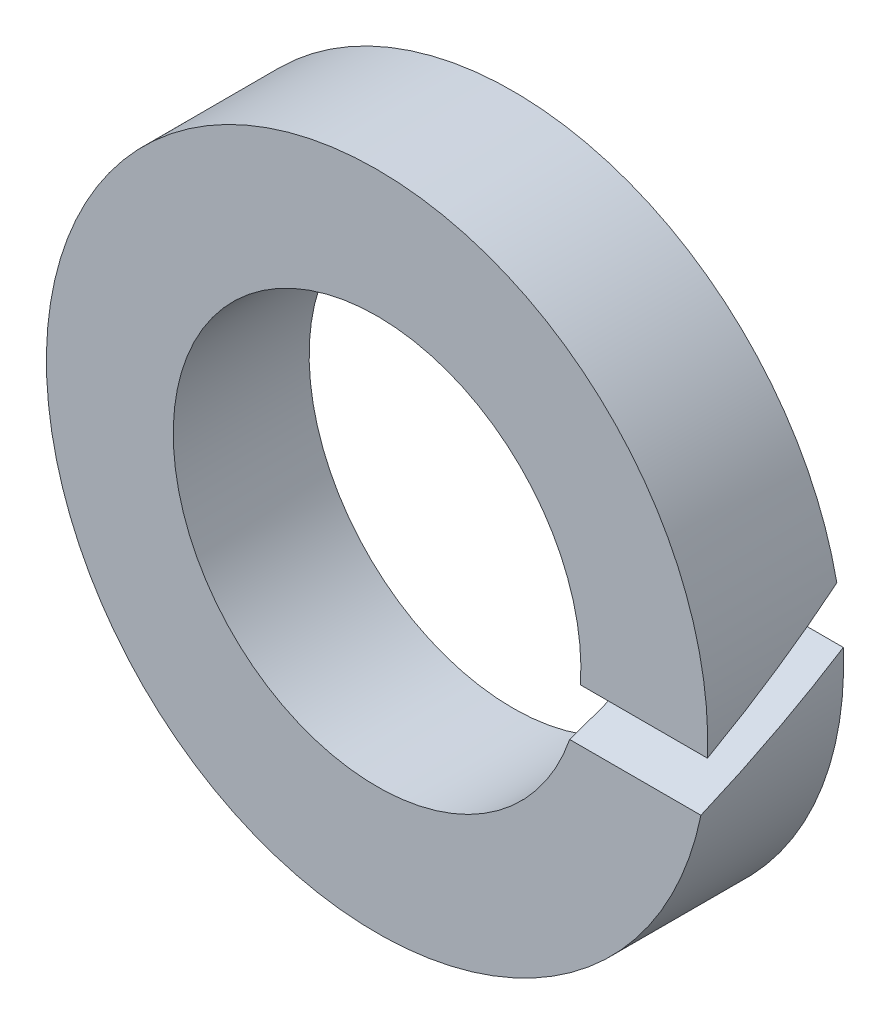
ISO-10303-21;
HEADER;
FILE_DESCRIPTION(('STEP AP214'),'2;1');
FILE_NAME('part.step','',(''),(''),'','','');
FILE_SCHEMA(('AUTOMOTIVE_DESIGN { 1 0 10303 214 1 1 1 1 }'));
ENDSEC;
DATA;
#1=APPLICATION_CONTEXT('core data for automotive mechanical design processes');
#2=APPLICATION_PROTOCOL_DEFINITION('international standard','automotive_design',2000,#1);
#3=PRODUCT_CONTEXT('',#1,'mechanical');
#4=PRODUCT('Part','Part','',(#3));
#5=PRODUCT_RELATED_PRODUCT_CATEGORY('part','',(#4));
#6=PRODUCT_DEFINITION_FORMATION('','',#4);
#7=PRODUCT_DEFINITION_CONTEXT('part definition',#1,'design');
#8=PRODUCT_DEFINITION('design','',#6,#7);
#9=PRODUCT_DEFINITION_SHAPE('','',#8);
#10=(LENGTH_UNIT() NAMED_UNIT(*) SI_UNIT(.MILLI.,.METRE.));
#11=(NAMED_UNIT(*) PLANE_ANGLE_UNIT() SI_UNIT($,.RADIAN.));
#12=(NAMED_UNIT(*) SI_UNIT($,.STERADIAN.) SOLID_ANGLE_UNIT());
#13=UNCERTAINTY_MEASURE_WITH_UNIT(LENGTH_MEASURE(1.E-05),#10,'distance_accuracy_value','');
#14=(GEOMETRIC_REPRESENTATION_CONTEXT(3) GLOBAL_UNCERTAINTY_ASSIGNED_CONTEXT((#13)) GLOBAL_UNIT_ASSIGNED_CONTEXT((#10,
#11,#12)) REPRESENTATION_CONTEXT('',''));
#15=CARTESIAN_POINT('',(0.,0.,0.));
#16=DIRECTION('',(0.,0.,1.));
#17=DIRECTION('',(1.,0.,0.));
#18=AXIS2_PLACEMENT_3D('',#15,#16,#17);
#19=CARTESIAN_POINT('',(0.,0.,1.5));
#20=DIRECTION('',(0.,0.,1.));
#21=DIRECTION('',(1.,0.,0.));
#22=AXIS2_PLACEMENT_3D('',#19,#20,#21);
#23=PLANE('',#22);
#24=CARTESIAN_POINT('',(0.,0.,1.5));
#25=DIRECTION('',(0.,0.,1.));
#26=DIRECTION('',(1.,0.,0.));
#27=AXIS2_PLACEMENT_3D('',#24,#25,#26);
#28=CIRCLE('',#27,3.65);
#29=CARTESIAN_POINT('',(3.64673621354377,-0.154321057627028,1.5));
#30=VERTEX_POINT('',#29);
#31=CARTESIAN_POINT('',(3.57508384039289,-0.735714301996038,1.5));
#32=VERTEX_POINT('',#31);
#33=EDGE_CURVE('E78',#30,#32,#28,.T.);
#34=ORIENTED_EDGE('',*,*,#33,.T.);
#35=DIRECTION('',(-1.,0.,0.));
#36=VECTOR('',#35,1.);
#37=CARTESIAN_POINT('',(3.64999999999992,-0.735714301995983,1.5));
#38=LINE('',#37,#36);
#39=CARTESIAN_POINT('',(2.12631711318838,-0.735714301995871,1.5));
#40=VERTEX_POINT('',#39);
#41=EDGE_CURVE('E80',#32,#40,#38,.T.);
#42=ORIENTED_EDGE('',*,*,#41,.T.);
#43=CARTESIAN_POINT('',(0.,0.,1.5));
#44=DIRECTION('',(0.,0.,1.));
#45=DIRECTION('',(1.,0.,0.));
#46=AXIS2_PLACEMENT_3D('',#43,#44,#45);
#47=CIRCLE('',#46,2.25);
#48=CARTESIAN_POINT('',(2.24470154166919,-0.154321057627055,1.5));
#49=VERTEX_POINT('',#48);
#50=EDGE_CURVE('E90',#49,#40,#47,.T.);
#51=ORIENTED_EDGE('',*,*,#50,.F.);
#52=DIRECTION('',(-1.,0.,0.));
#53=VECTOR('',#52,1.);
#54=CARTESIAN_POINT('',(3.64999999999992,-0.154321057627167,1.5));
#55=LINE('',#54,#53);
#56=EDGE_CURVE('E54',#30,#49,#55,.T.);
#57=ORIENTED_EDGE('',*,*,#56,.F.);
#58=EDGE_LOOP('',(#34,#42,#51,#57));
#59=FACE_BOUND('',#58,.T.);
#60=ADVANCED_FACE('F32',(#59),#23,.T.);
#61=CARTESIAN_POINT('',(0.,0.,0.));
#62=DIRECTION('',(0.,0.,1.));
#63=DIRECTION('',(1.,0.,0.));
#64=AXIS2_PLACEMENT_3D('',#61,#62,#63);
#65=PLANE('',#64);
#66=DIRECTION('',(-1.,0.,0.));
#67=VECTOR('',#66,1.);
#68=CARTESIAN_POINT('',(3.64999999999984,0.154321057627443,0.));
#69=LINE('',#68,#67);
#70=CARTESIAN_POINT('',(3.64673621354383,0.154321057627359,0.));
#71=VERTEX_POINT('',#70);
#72=CARTESIAN_POINT('',(2.24470154166922,0.154321057627305,0.));
#73=VERTEX_POINT('',#72);
#74=EDGE_CURVE('E47',#71,#73,#69,.T.);
#75=ORIENTED_EDGE('',*,*,#74,.F.);
#76=CARTESIAN_POINT('',(0.,0.,0.));
#77=DIRECTION('',(0.,0.,1.));
#78=DIRECTION('',(1.,0.,0.));
#79=AXIS2_PLACEMENT_3D('',#76,#77,#78);
#80=CIRCLE('',#79,3.65);
#81=CARTESIAN_POINT('',(3.57508384039275,0.735714301996239,0.));
#82=VERTEX_POINT('',#81);
#83=EDGE_CURVE('E76',#82,#71,#80,.T.);
#84=ORIENTED_EDGE('',*,*,#83,.F.);
#85=DIRECTION('',(-1.,0.,0.));
#86=VECTOR('',#85,1.);
#87=CARTESIAN_POINT('',(3.64999999999987,0.735714301996231,0.));
#88=LINE('',#87,#86);
#89=CARTESIAN_POINT('',(2.12631711318841,0.735714301996288,0.));
#90=VERTEX_POINT('',#89);
#91=EDGE_CURVE('E83',#82,#90,#88,.T.);
#92=ORIENTED_EDGE('',*,*,#91,.T.);
#93=CARTESIAN_POINT('',(0.,0.,0.));
#94=DIRECTION('',(0.,0.,1.));
#95=DIRECTION('',(1.,0.,0.));
#96=AXIS2_PLACEMENT_3D('',#93,#94,#95);
#97=CIRCLE('',#96,2.25);
#98=EDGE_CURVE('E94',#90,#73,#97,.T.);
#99=ORIENTED_EDGE('',*,*,#98,.T.);
#100=EDGE_LOOP('',(#75,#84,#92,#99));
#101=FACE_BOUND('',#100,.T.);
#102=ADVANCED_FACE('F89',(#101),#65,.F.);
#103=CARTESIAN_POINT('',(0.,0.,1.5));
#104=DIRECTION('',(0.,0.,-1.));
#105=DIRECTION('',(-1.,0.,0.));
#106=AXIS2_PLACEMENT_3D('',#103,#104,#105);
#107=CYLINDRICAL_SURFACE('',#106,3.65);
#108=CARTESIAN_POINT('',(0.,0.,0.26008133714911));
#109=DIRECTION('',(0.,0.860003112940858,0.510288786602296));
#110=DIRECTION('',(0.,0.510288786602297,-0.860003112940853));
#111=AXIS2_PLACEMENT_3D('',#108,#109,#110);
#112=ELLIPSE('',#111,7.15281247762301,3.65);
#113=EDGE_CURVE('E79',#32,#71,#112,.T.);
#114=ORIENTED_EDGE('',*,*,#113,.F.);
#115=ORIENTED_EDGE('',*,*,#33,.F.);
#116=CARTESIAN_POINT('',(0.,0.,1.23991866285089));
#117=DIRECTION('',(0.,0.860003112940859,0.510288786602296));
#118=DIRECTION('',(0.,0.510288786602297,-0.860003112940853));
#119=AXIS2_PLACEMENT_3D('',#116,#117,#118);
#120=ELLIPSE('',#119,7.15281247762301,3.65);
#121=EDGE_CURVE('E72',#30,#82,#120,.T.);
#122=ORIENTED_EDGE('',*,*,#121,.T.);
#123=ORIENTED_EDGE('',*,*,#83,.T.);
#124=EDGE_LOOP('',(#114,#115,#122,#123));
#125=FACE_BOUND('',#124,.T.);
#126=ADVANCED_FACE('F34',(#125),#107,.T.);
#127=CARTESIAN_POINT('',(0.,0.,1.5));
#128=DIRECTION('',(0.,0.,-1.));
#129=DIRECTION('',(-1.,0.,0.));
#130=AXIS2_PLACEMENT_3D('',#127,#128,#129);
#131=CYLINDRICAL_SURFACE('',#130,2.25);
#132=ORIENTED_EDGE('',*,*,#50,.T.);
#133=CARTESIAN_POINT('',(0.,0.,0.26008133714911));
#134=DIRECTION('',(0.,0.860003112940858,0.510288786602296));
#135=DIRECTION('',(0.,0.510288786602297,-0.860003112940853));
#136=AXIS2_PLACEMENT_3D('',#133,#134,#135);
#137=ELLIPSE('',#136,4.40926796565802,2.25);
#138=EDGE_CURVE('E11',#40,#73,#137,.T.);
#139=ORIENTED_EDGE('',*,*,#138,.T.);
#140=ORIENTED_EDGE('',*,*,#98,.F.);
#141=CARTESIAN_POINT('',(0.,0.,1.23991866285089));
#142=DIRECTION('',(0.,0.860003112940859,0.510288786602296));
#143=DIRECTION('',(0.,0.510288786602297,-0.860003112940853));
#144=AXIS2_PLACEMENT_3D('',#141,#142,#143);
#145=ELLIPSE('',#144,4.40926796565802,2.25);
#146=EDGE_CURVE('E40',#49,#90,#145,.T.);
#147=ORIENTED_EDGE('',*,*,#146,.F.);
#148=EDGE_LOOP('',(#132,#139,#140,#147));
#149=FACE_BOUND('',#148,.T.);
#150=ADVANCED_FACE('F105',(#149),#131,.F.);
#151=CARTESIAN_POINT('',(3.64999999999992,-0.154321057627167,1.5));
#152=DIRECTION('',(0.,0.860003112940859,0.510288786602296));
#153=DIRECTION('',(0.,-0.510288786602297,0.860003112940853));
#154=AXIS2_PLACEMENT_3D('',#151,#152,#153);
#155=PLANE('',#154);
#156=ORIENTED_EDGE('',*,*,#56,.T.);
#157=ORIENTED_EDGE('',*,*,#146,.T.);
#158=ORIENTED_EDGE('',*,*,#91,.F.);
#159=ORIENTED_EDGE('',*,*,#121,.F.);
#160=EDGE_LOOP('',(#156,#157,#158,#159));
#161=FACE_BOUND('',#160,.T.);
#162=ADVANCED_FACE('F84',(#161),#155,.F.);
#163=CARTESIAN_POINT('',(3.64999999999992,-0.735714301995983,1.5));
#164=DIRECTION('',(0.,0.860003112940858,0.510288786602296));
#165=DIRECTION('',(0.,-0.510288786602297,0.860003112940853));
#166=AXIS2_PLACEMENT_3D('',#163,#164,#165);
#167=PLANE('',#166);
#168=ORIENTED_EDGE('',*,*,#113,.T.);
#169=ORIENTED_EDGE('',*,*,#74,.T.);
#170=ORIENTED_EDGE('',*,*,#138,.F.);
#171=ORIENTED_EDGE('',*,*,#41,.F.);
#172=EDGE_LOOP('',(#168,#169,#170,#171));
#173=FACE_BOUND('',#172,.T.);
#174=ADVANCED_FACE('F106',(#173),#167,.T.);
#175=CLOSED_SHELL('',(#60,#102,#126,#150,#162,#174));
#176=MANIFOLD_SOLID_BREP('B2',#175);
#177=ADVANCED_BREP_SHAPE_REPRESENTATION('',(#18,#176),#14);
#178=SHAPE_DEFINITION_REPRESENTATION(#9,#177);
ENDSEC;
END-ISO-10303-21;
